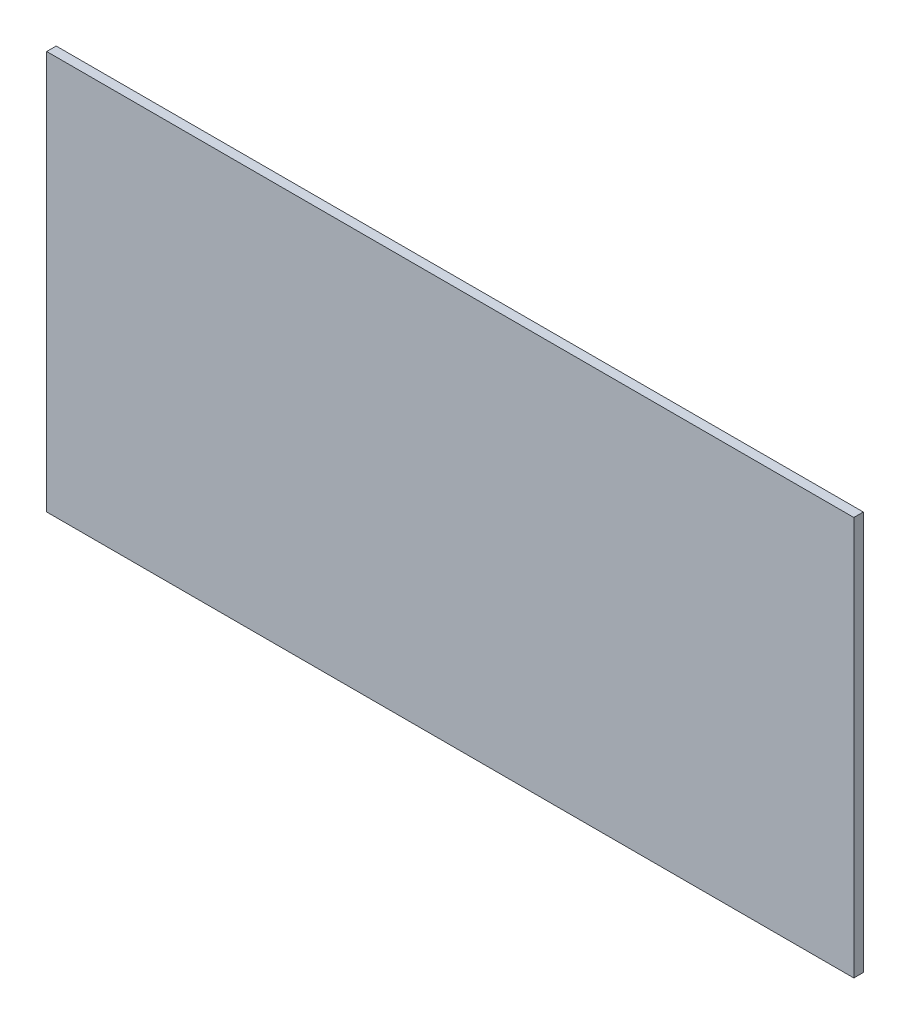
ISO-10303-21;
HEADER;
FILE_DESCRIPTION(('STEP AP214'),'2;1');
FILE_NAME('part.step','',(''),(''),'','','');
FILE_SCHEMA(('AUTOMOTIVE_DESIGN { 1 0 10303 214 1 1 1 1 }'));
ENDSEC;
DATA;
#1=APPLICATION_CONTEXT('core data for automotive mechanical design processes');
#2=APPLICATION_PROTOCOL_DEFINITION('international standard','automotive_design',2000,#1);
#3=PRODUCT_CONTEXT('',#1,'mechanical');
#4=PRODUCT('Part','Part','',(#3));
#5=PRODUCT_RELATED_PRODUCT_CATEGORY('part','',(#4));
#6=PRODUCT_DEFINITION_FORMATION('','',#4);
#7=PRODUCT_DEFINITION_CONTEXT('part definition',#1,'design');
#8=PRODUCT_DEFINITION('design','',#6,#7);
#9=PRODUCT_DEFINITION_SHAPE('','',#8);
#10=(LENGTH_UNIT() NAMED_UNIT(*) SI_UNIT(.MILLI.,.METRE.));
#11=(NAMED_UNIT(*) PLANE_ANGLE_UNIT() SI_UNIT($,.RADIAN.));
#12=(NAMED_UNIT(*) SI_UNIT($,.STERADIAN.) SOLID_ANGLE_UNIT());
#13=UNCERTAINTY_MEASURE_WITH_UNIT(LENGTH_MEASURE(1.E-05),#10,'distance_accuracy_value','');
#14=(GEOMETRIC_REPRESENTATION_CONTEXT(3) GLOBAL_UNCERTAINTY_ASSIGNED_CONTEXT((#13)) GLOBAL_UNIT_ASSIGNED_CONTEXT((#10,
#11,#12)) REPRESENTATION_CONTEXT('',''));
#15=CARTESIAN_POINT('',(0.,0.,0.));
#16=DIRECTION('',(0.,0.,1.));
#17=DIRECTION('',(1.,0.,0.));
#18=AXIS2_PLACEMENT_3D('',#15,#16,#17);
#19=CARTESIAN_POINT('',(170.,-84.,0.));
#20=DIRECTION('',(1.,0.,0.));
#21=DIRECTION('',(0.,1.,0.));
#22=AXIS2_PLACEMENT_3D('',#19,#20,#21);
#23=PLANE('',#22);
#24=DIRECTION('',(0.,0.,1.));
#25=VECTOR('',#24,1.);
#26=CARTESIAN_POINT('',(170.,-84.,0.));
#27=LINE('',#26,#25);
#28=CARTESIAN_POINT('',(170.,-84.,-4.));
#29=VERTEX_POINT('',#28);
#30=CARTESIAN_POINT('',(170.,-84.,0.));
#31=VERTEX_POINT('',#30);
#32=EDGE_CURVE('E11',#29,#31,#27,.T.);
#33=ORIENTED_EDGE('',*,*,#32,.F.);
#34=DIRECTION('',(0.,1.,0.));
#35=VECTOR('',#34,1.);
#36=CARTESIAN_POINT('',(170.,0.,-4.));
#37=LINE('',#36,#35);
#38=CARTESIAN_POINT('',(170.,84.,-4.));
#39=VERTEX_POINT('',#38);
#40=EDGE_CURVE('E91',#29,#39,#37,.T.);
#41=ORIENTED_EDGE('',*,*,#40,.T.);
#42=DIRECTION('',(0.,0.,1.));
#43=VECTOR('',#42,1.);
#44=CARTESIAN_POINT('',(170.,84.,0.));
#45=LINE('',#44,#43);
#46=CARTESIAN_POINT('',(170.,84.,0.));
#47=VERTEX_POINT('',#46);
#48=EDGE_CURVE('E47',#39,#47,#45,.T.);
#49=ORIENTED_EDGE('',*,*,#48,.T.);
#50=DIRECTION('',(0.,1.,0.));
#51=VECTOR('',#50,1.);
#52=CARTESIAN_POINT('',(170.,-84.,0.));
#53=LINE('',#52,#51);
#54=EDGE_CURVE('E104',#31,#47,#53,.T.);
#55=ORIENTED_EDGE('',*,*,#54,.F.);
#56=EDGE_LOOP('',(#33,#41,#49,#55));
#57=FACE_BOUND('',#56,.T.);
#58=ADVANCED_FACE('F37',(#57),#23,.T.);
#59=CARTESIAN_POINT('',(170.,84.,0.));
#60=DIRECTION('',(0.,1.,0.));
#61=DIRECTION('',(-1.,0.,0.));
#62=AXIS2_PLACEMENT_3D('',#59,#60,#61);
#63=PLANE('',#62);
#64=ORIENTED_EDGE('',*,*,#48,.F.);
#65=DIRECTION('',(1.,0.,0.));
#66=VECTOR('',#65,1.);
#67=CARTESIAN_POINT('',(0.,84.,-4.));
#68=LINE('',#67,#66);
#69=CARTESIAN_POINT('',(-170.,84.,-4.));
#70=VERTEX_POINT('',#69);
#71=EDGE_CURVE('E98',#39,#70,#68,.F.);
#72=ORIENTED_EDGE('',*,*,#71,.T.);
#73=DIRECTION('',(0.,0.,1.));
#74=VECTOR('',#73,1.);
#75=CARTESIAN_POINT('',(-170.,84.,0.));
#76=LINE('',#75,#74);
#77=CARTESIAN_POINT('',(-170.,84.,0.));
#78=VERTEX_POINT('',#77);
#79=EDGE_CURVE('E55',#70,#78,#76,.T.);
#80=ORIENTED_EDGE('',*,*,#79,.T.);
#81=DIRECTION('',(-1.,0.,0.));
#82=VECTOR('',#81,1.);
#83=CARTESIAN_POINT('',(170.,84.,0.));
#84=LINE('',#83,#82);
#85=EDGE_CURVE('E85',#47,#78,#84,.T.);
#86=ORIENTED_EDGE('',*,*,#85,.F.);
#87=EDGE_LOOP('',(#64,#72,#80,#86));
#88=FACE_BOUND('',#87,.T.);
#89=ADVANCED_FACE('F108',(#88),#63,.T.);
#90=CARTESIAN_POINT('',(-170.,-84.,0.));
#91=DIRECTION('',(-1.,0.,0.));
#92=DIRECTION('',(0.,-1.,0.));
#93=AXIS2_PLACEMENT_3D('',#90,#91,#92);
#94=PLANE('',#93);
#95=ORIENTED_EDGE('',*,*,#79,.F.);
#96=DIRECTION('',(0.,1.,0.));
#97=VECTOR('',#96,1.);
#98=CARTESIAN_POINT('',(-170.,0.,-4.));
#99=LINE('',#98,#97);
#100=CARTESIAN_POINT('',(-170.,-84.,-4.));
#101=VERTEX_POINT('',#100);
#102=EDGE_CURVE('E90',#70,#101,#99,.F.);
#103=ORIENTED_EDGE('',*,*,#102,.T.);
#104=DIRECTION('',(0.,0.,1.));
#105=VECTOR('',#104,1.);
#106=CARTESIAN_POINT('',(-170.,-84.,0.));
#107=LINE('',#106,#105);
#108=CARTESIAN_POINT('',(-170.,-84.,0.));
#109=VERTEX_POINT('',#108);
#110=EDGE_CURVE('E41',#101,#109,#107,.T.);
#111=ORIENTED_EDGE('',*,*,#110,.T.);
#112=DIRECTION('',(0.,-1.,0.));
#113=VECTOR('',#112,1.);
#114=CARTESIAN_POINT('',(-170.,-84.,0.));
#115=LINE('',#114,#113);
#116=EDGE_CURVE('E100',#78,#109,#115,.T.);
#117=ORIENTED_EDGE('',*,*,#116,.F.);
#118=EDGE_LOOP('',(#95,#103,#111,#117));
#119=FACE_BOUND('',#118,.T.);
#120=ADVANCED_FACE('F93',(#119),#94,.T.);
#121=CARTESIAN_POINT('',(170.,-84.,0.));
#122=DIRECTION('',(0.,-1.,0.));
#123=DIRECTION('',(1.,0.,0.));
#124=AXIS2_PLACEMENT_3D('',#121,#122,#123);
#125=PLANE('',#124);
#126=DIRECTION('',(1.,0.,0.));
#127=VECTOR('',#126,1.);
#128=CARTESIAN_POINT('',(0.,-84.,-4.));
#129=LINE('',#128,#127);
#130=EDGE_CURVE('E79',#101,#29,#129,.T.);
#131=ORIENTED_EDGE('',*,*,#130,.T.);
#132=ORIENTED_EDGE('',*,*,#32,.T.);
#133=DIRECTION('',(1.,0.,0.));
#134=VECTOR('',#133,1.);
#135=CARTESIAN_POINT('',(170.,-84.,0.));
#136=LINE('',#135,#134);
#137=EDGE_CURVE('E81',#109,#31,#136,.T.);
#138=ORIENTED_EDGE('',*,*,#137,.F.);
#139=ORIENTED_EDGE('',*,*,#110,.F.);
#140=EDGE_LOOP('',(#131,#132,#138,#139));
#141=FACE_BOUND('',#140,.T.);
#142=ADVANCED_FACE('F39',(#141),#125,.T.);
#143=CARTESIAN_POINT('',(0.,0.,0.));
#144=DIRECTION('',(0.,0.,1.));
#145=DIRECTION('',(1.,0.,0.));
#146=AXIS2_PLACEMENT_3D('',#143,#144,#145);
#147=PLANE('',#146);
#148=ORIENTED_EDGE('',*,*,#116,.T.);
#149=ORIENTED_EDGE('',*,*,#137,.T.);
#150=ORIENTED_EDGE('',*,*,#54,.T.);
#151=ORIENTED_EDGE('',*,*,#85,.T.);
#152=EDGE_LOOP('',(#148,#149,#150,#151));
#153=FACE_BOUND('',#152,.T.);
#154=ADVANCED_FACE('F107',(#153),#147,.T.);
#155=CARTESIAN_POINT('',(0.,0.,-4.));
#156=DIRECTION('',(0.,0.,1.));
#157=DIRECTION('',(1.,0.,0.));
#158=AXIS2_PLACEMENT_3D('',#155,#156,#157);
#159=PLANE('',#158);
#160=ORIENTED_EDGE('',*,*,#102,.F.);
#161=ORIENTED_EDGE('',*,*,#71,.F.);
#162=ORIENTED_EDGE('',*,*,#40,.F.);
#163=ORIENTED_EDGE('',*,*,#130,.F.);
#164=EDGE_LOOP('',(#160,#161,#162,#163));
#165=FACE_BOUND('',#164,.T.);
#166=ADVANCED_FACE('F88',(#165),#159,.F.);
#167=CLOSED_SHELL('',(#58,#89,#120,#142,#154,#166));
#168=MANIFOLD_SOLID_BREP('B2',#167);
#169=ADVANCED_BREP_SHAPE_REPRESENTATION('',(#18,#168),#14);
#170=SHAPE_DEFINITION_REPRESENTATION(#9,#169);
ENDSEC;
END-ISO-10303-21;
